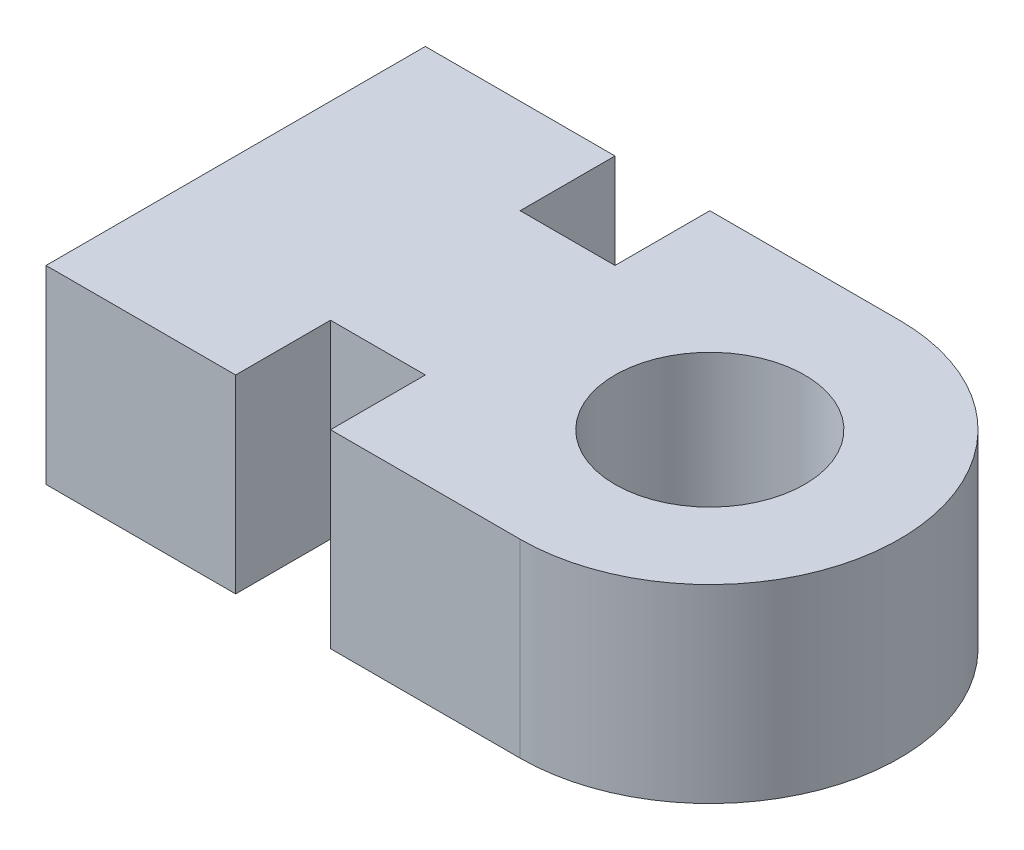
ISO-10303-21;
HEADER;
FILE_DESCRIPTION(('STEP AP214'),'2;1');
FILE_NAME('part.step','',(''),(''),'','','');
FILE_SCHEMA(('AUTOMOTIVE_DESIGN { 1 0 10303 214 1 1 1 1 }'));
ENDSEC;
DATA;
#1=APPLICATION_CONTEXT('core data for automotive mechanical design processes');
#2=APPLICATION_PROTOCOL_DEFINITION('international standard','automotive_design',2000,#1);
#3=PRODUCT_CONTEXT('',#1,'mechanical');
#4=PRODUCT('Part','Part','',(#3));
#5=PRODUCT_RELATED_PRODUCT_CATEGORY('part','',(#4));
#6=PRODUCT_DEFINITION_FORMATION('','',#4);
#7=PRODUCT_DEFINITION_CONTEXT('part definition',#1,'design');
#8=PRODUCT_DEFINITION('design','',#6,#7);
#9=PRODUCT_DEFINITION_SHAPE('','',#8);
#10=(LENGTH_UNIT() NAMED_UNIT(*) SI_UNIT(.MILLI.,.METRE.));
#11=(NAMED_UNIT(*) PLANE_ANGLE_UNIT() SI_UNIT($,.RADIAN.));
#12=(NAMED_UNIT(*) SI_UNIT($,.STERADIAN.) SOLID_ANGLE_UNIT());
#13=UNCERTAINTY_MEASURE_WITH_UNIT(LENGTH_MEASURE(1.E-05),#10,'distance_accuracy_value','');
#14=(GEOMETRIC_REPRESENTATION_CONTEXT(3) GLOBAL_UNCERTAINTY_ASSIGNED_CONTEXT((#13)) GLOBAL_UNIT_ASSIGNED_CONTEXT((#10,
#11,#12)) REPRESENTATION_CONTEXT('',''));
#15=CARTESIAN_POINT('',(0.,0.,0.));
#16=DIRECTION('',(0.,0.,1.));
#17=DIRECTION('',(1.,0.,0.));
#18=AXIS2_PLACEMENT_3D('',#15,#16,#17);
#19=CARTESIAN_POINT('',(0.,10.,10.));
#20=DIRECTION('',(0.,0.,1.));
#21=DIRECTION('',(1.,0.,0.));
#22=AXIS2_PLACEMENT_3D('',#19,#20,#21);
#23=PLANE('',#22);
#24=DIRECTION('',(-1.,0.,0.));
#25=VECTOR('',#24,1.);
#26=CARTESIAN_POINT('',(0.,0.,10.));
#27=LINE('',#26,#25);
#28=CARTESIAN_POINT('',(0.,0.,10.));
#29=VERTEX_POINT('',#28);
#30=CARTESIAN_POINT('',(-10.,0.,10.));
#31=VERTEX_POINT('',#30);
#32=EDGE_CURVE('E187',#29,#31,#27,.T.);
#33=ORIENTED_EDGE('',*,*,#32,.F.);
#34=DIRECTION('',(0.,-1.,0.));
#35=VECTOR('',#34,1.);
#36=CARTESIAN_POINT('',(0.,10.,10.));
#37=LINE('',#36,#35);
#38=CARTESIAN_POINT('',(0.,10.,10.));
#39=VERTEX_POINT('',#38);
#40=EDGE_CURVE('E11',#39,#29,#37,.T.);
#41=ORIENTED_EDGE('',*,*,#40,.F.);
#42=DIRECTION('',(-1.,0.,0.));
#43=VECTOR('',#42,1.);
#44=CARTESIAN_POINT('',(0.,10.,10.));
#45=LINE('',#44,#43);
#46=CARTESIAN_POINT('',(-10.,10.,10.));
#47=VERTEX_POINT('',#46);
#48=EDGE_CURVE('E277',#39,#47,#45,.T.);
#49=ORIENTED_EDGE('',*,*,#48,.T.);
#50=DIRECTION('',(0.,-1.,0.));
#51=VECTOR('',#50,1.);
#52=CARTESIAN_POINT('',(-10.,10.,10.));
#53=LINE('',#52,#51);
#54=EDGE_CURVE('E56',#47,#31,#53,.T.);
#55=ORIENTED_EDGE('',*,*,#54,.T.);
#56=EDGE_LOOP('',(#33,#41,#49,#55));
#57=FACE_BOUND('',#56,.T.);
#58=ADVANCED_FACE('F39',(#57),#23,.T.);
#59=CARTESIAN_POINT('',(0.,10.,0.));
#60=DIRECTION('',(0.,-1.,0.));
#61=DIRECTION('',(0.,0.,-1.));
#62=AXIS2_PLACEMENT_3D('',#59,#60,#61);
#63=CYLINDRICAL_SURFACE('',#62,10.);
#64=CARTESIAN_POINT('',(0.,0.,0.));
#65=DIRECTION('',(0.,1.,0.));
#66=DIRECTION('',(0.,0.,1.));
#67=AXIS2_PLACEMENT_3D('',#64,#65,#66);
#68=CIRCLE('',#67,10.);
#69=CARTESIAN_POINT('',(0.,0.,-10.));
#70=VERTEX_POINT('',#69);
#71=EDGE_CURVE('E184',#29,#70,#68,.T.);
#72=ORIENTED_EDGE('',*,*,#71,.T.);
#73=DIRECTION('',(0.,-1.,0.));
#74=VECTOR('',#73,1.);
#75=CARTESIAN_POINT('',(0.,10.,-10.));
#76=LINE('',#75,#74);
#77=CARTESIAN_POINT('',(0.,10.,-10.));
#78=VERTEX_POINT('',#77);
#79=EDGE_CURVE('E48',#78,#70,#76,.T.);
#80=ORIENTED_EDGE('',*,*,#79,.F.);
#81=CARTESIAN_POINT('',(0.,10.,0.));
#82=DIRECTION('',(0.,1.,0.));
#83=DIRECTION('',(0.,0.,1.));
#84=AXIS2_PLACEMENT_3D('',#81,#82,#83);
#85=CIRCLE('',#84,10.);
#86=EDGE_CURVE('E275',#39,#78,#85,.T.);
#87=ORIENTED_EDGE('',*,*,#86,.F.);
#88=ORIENTED_EDGE('',*,*,#40,.T.);
#89=EDGE_LOOP('',(#72,#80,#87,#88));
#90=FACE_BOUND('',#89,.T.);
#91=ADVANCED_FACE('F185',(#90),#63,.T.);
#92=CARTESIAN_POINT('',(0.,10.,-10.));
#93=DIRECTION('',(0.,0.,1.));
#94=DIRECTION('',(1.,0.,0.));
#95=AXIS2_PLACEMENT_3D('',#92,#93,#94);
#96=PLANE('',#95);
#97=DIRECTION('',(-1.,0.,0.));
#98=VECTOR('',#97,1.);
#99=CARTESIAN_POINT('',(0.,0.,-10.));
#100=LINE('',#99,#98);
#101=CARTESIAN_POINT('',(-10.,0.,-10.));
#102=VERTEX_POINT('',#101);
#103=EDGE_CURVE('E178',#70,#102,#100,.T.);
#104=ORIENTED_EDGE('',*,*,#103,.T.);
#105=DIRECTION('',(0.,-1.,0.));
#106=VECTOR('',#105,1.);
#107=CARTESIAN_POINT('',(-10.,10.,-10.));
#108=LINE('',#107,#106);
#109=CARTESIAN_POINT('',(-10.,10.,-10.));
#110=VERTEX_POINT('',#109);
#111=EDGE_CURVE('E169',#110,#102,#108,.T.);
#112=ORIENTED_EDGE('',*,*,#111,.F.);
#113=DIRECTION('',(-1.,0.,0.));
#114=VECTOR('',#113,1.);
#115=CARTESIAN_POINT('',(0.,10.,-10.));
#116=LINE('',#115,#114);
#117=EDGE_CURVE('E180',#78,#110,#116,.T.);
#118=ORIENTED_EDGE('',*,*,#117,.F.);
#119=ORIENTED_EDGE('',*,*,#79,.T.);
#120=EDGE_LOOP('',(#104,#112,#118,#119));
#121=FACE_BOUND('',#120,.T.);
#122=ADVANCED_FACE('F176',(#121),#96,.F.);
#123=CARTESIAN_POINT('',(-10.,10.,0.));
#124=DIRECTION('',(1.,0.,0.));
#125=DIRECTION('',(0.,0.,-1.));
#126=AXIS2_PLACEMENT_3D('',#123,#124,#125);
#127=PLANE('',#126);
#128=DIRECTION('',(0.,0.,1.));
#129=VECTOR('',#128,1.);
#130=CARTESIAN_POINT('',(-10.,0.,0.));
#131=LINE('',#130,#129);
#132=CARTESIAN_POINT('',(-10.,0.,-5.));
#133=VERTEX_POINT('',#132);
#134=EDGE_CURVE('E189',#102,#133,#131,.T.);
#135=ORIENTED_EDGE('',*,*,#134,.T.);
#136=DIRECTION('',(0.,-1.,0.));
#137=VECTOR('',#136,1.);
#138=CARTESIAN_POINT('',(-10.,10.,-5.));
#139=LINE('',#138,#137);
#140=CARTESIAN_POINT('',(-10.,10.,-5.));
#141=VERTEX_POINT('',#140);
#142=EDGE_CURVE('E167',#141,#133,#139,.T.);
#143=ORIENTED_EDGE('',*,*,#142,.F.);
#144=DIRECTION('',(0.,0.,1.));
#145=VECTOR('',#144,1.);
#146=CARTESIAN_POINT('',(-10.,10.,0.));
#147=LINE('',#146,#145);
#148=EDGE_CURVE('E273',#110,#141,#147,.T.);
#149=ORIENTED_EDGE('',*,*,#148,.F.);
#150=ORIENTED_EDGE('',*,*,#111,.T.);
#151=EDGE_LOOP('',(#135,#143,#149,#150));
#152=FACE_BOUND('',#151,.T.);
#153=ADVANCED_FACE('F272',(#152),#127,.F.);
#154=CARTESIAN_POINT('',(0.,10.,-5.));
#155=DIRECTION('',(0.,0.,-1.));
#156=DIRECTION('',(-1.,0.,0.));
#157=AXIS2_PLACEMENT_3D('',#154,#155,#156);
#158=PLANE('',#157);
#159=DIRECTION('',(1.,0.,0.));
#160=VECTOR('',#159,1.);
#161=CARTESIAN_POINT('',(0.,0.,-5.));
#162=LINE('',#161,#160);
#163=CARTESIAN_POINT('',(-15.,0.,-5.));
#164=VERTEX_POINT('',#163);
#165=EDGE_CURVE('E199',#164,#133,#162,.T.);
#166=ORIENTED_EDGE('',*,*,#165,.F.);
#167=DIRECTION('',(0.,-1.,0.));
#168=VECTOR('',#167,1.);
#169=CARTESIAN_POINT('',(-15.,10.,-5.));
#170=LINE('',#169,#168);
#171=CARTESIAN_POINT('',(-15.,10.,-5.));
#172=VERTEX_POINT('',#171);
#173=EDGE_CURVE('E165',#172,#164,#170,.T.);
#174=ORIENTED_EDGE('',*,*,#173,.F.);
#175=DIRECTION('',(1.,0.,0.));
#176=VECTOR('',#175,1.);
#177=CARTESIAN_POINT('',(0.,10.,-5.));
#178=LINE('',#177,#176);
#179=EDGE_CURVE('E270',#172,#141,#178,.T.);
#180=ORIENTED_EDGE('',*,*,#179,.T.);
#181=ORIENTED_EDGE('',*,*,#142,.T.);
#182=EDGE_LOOP('',(#166,#174,#180,#181));
#183=FACE_BOUND('',#182,.T.);
#184=ADVANCED_FACE('F266',(#183),#158,.T.);
#185=CARTESIAN_POINT('',(-15.,10.,0.));
#186=DIRECTION('',(1.,0.,0.));
#187=DIRECTION('',(0.,0.,-1.));
#188=AXIS2_PLACEMENT_3D('',#185,#186,#187);
#189=PLANE('',#188);
#190=DIRECTION('',(0.,0.,1.));
#191=VECTOR('',#190,1.);
#192=CARTESIAN_POINT('',(-15.,0.,0.));
#193=LINE('',#192,#191);
#194=CARTESIAN_POINT('',(-15.,0.,-10.));
#195=VERTEX_POINT('',#194);
#196=EDGE_CURVE('E202',#195,#164,#193,.T.);
#197=ORIENTED_EDGE('',*,*,#196,.F.);
#198=DIRECTION('',(0.,-1.,0.));
#199=VECTOR('',#198,1.);
#200=CARTESIAN_POINT('',(-15.,10.,-10.));
#201=LINE('',#200,#199);
#202=CARTESIAN_POINT('',(-15.,10.,-10.));
#203=VERTEX_POINT('',#202);
#204=EDGE_CURVE('E163',#203,#195,#201,.T.);
#205=ORIENTED_EDGE('',*,*,#204,.F.);
#206=DIRECTION('',(0.,0.,1.));
#207=VECTOR('',#206,1.);
#208=CARTESIAN_POINT('',(-15.,10.,0.));
#209=LINE('',#208,#207);
#210=EDGE_CURVE('E263',#203,#172,#209,.T.);
#211=ORIENTED_EDGE('',*,*,#210,.T.);
#212=ORIENTED_EDGE('',*,*,#173,.T.);
#213=EDGE_LOOP('',(#197,#205,#211,#212));
#214=FACE_BOUND('',#213,.T.);
#215=ADVANCED_FACE('F262',(#214),#189,.T.);
#216=CARTESIAN_POINT('',(-25.,0.,-10.));
#217=VERTEX_POINT('',#216);
#218=EDGE_CURVE('E191',#195,#217,#100,.T.);
#219=ORIENTED_EDGE('',*,*,#218,.T.);
#220=DIRECTION('',(0.,-1.,0.));
#221=VECTOR('',#220,1.);
#222=CARTESIAN_POINT('',(-25.,10.,-10.));
#223=LINE('',#222,#221);
#224=CARTESIAN_POINT('',(-25.,10.,-10.));
#225=VERTEX_POINT('',#224);
#226=EDGE_CURVE('E160',#225,#217,#223,.T.);
#227=ORIENTED_EDGE('',*,*,#226,.F.);
#228=EDGE_CURVE('E258',#203,#225,#116,.T.);
#229=ORIENTED_EDGE('',*,*,#228,.F.);
#230=ORIENTED_EDGE('',*,*,#204,.T.);
#231=EDGE_LOOP('',(#219,#227,#229,#230));
#232=FACE_BOUND('',#231,.T.);
#233=ADVANCED_FACE('F245',(#232),#96,.F.);
#234=CARTESIAN_POINT('',(-25.,10.,0.));
#235=DIRECTION('',(1.,0.,0.));
#236=DIRECTION('',(0.,0.,-1.));
#237=AXIS2_PLACEMENT_3D('',#234,#235,#236);
#238=PLANE('',#237);
#239=DIRECTION('',(0.,0.,1.));
#240=VECTOR('',#239,1.);
#241=CARTESIAN_POINT('',(-25.,0.,0.));
#242=LINE('',#241,#240);
#243=CARTESIAN_POINT('',(-25.,0.,10.));
#244=VERTEX_POINT('',#243);
#245=EDGE_CURVE('E205',#217,#244,#242,.T.);
#246=ORIENTED_EDGE('',*,*,#245,.T.);
#247=DIRECTION('',(0.,-1.,0.));
#248=VECTOR('',#247,1.);
#249=CARTESIAN_POINT('',(-25.,10.,10.));
#250=LINE('',#249,#248);
#251=CARTESIAN_POINT('',(-25.,10.,10.));
#252=VERTEX_POINT('',#251);
#253=EDGE_CURVE('E154',#252,#244,#250,.T.);
#254=ORIENTED_EDGE('',*,*,#253,.F.);
#255=DIRECTION('',(0.,0.,1.));
#256=VECTOR('',#255,1.);
#257=CARTESIAN_POINT('',(-25.,10.,0.));
#258=LINE('',#257,#256);
#259=EDGE_CURVE('E254',#225,#252,#258,.T.);
#260=ORIENTED_EDGE('',*,*,#259,.F.);
#261=ORIENTED_EDGE('',*,*,#226,.T.);
#262=EDGE_LOOP('',(#246,#254,#260,#261));
#263=FACE_BOUND('',#262,.T.);
#264=ADVANCED_FACE('F239',(#263),#238,.F.);
#265=CARTESIAN_POINT('',(-15.,0.,10.));
#266=VERTEX_POINT('',#265);
#267=EDGE_CURVE('E194',#266,#244,#27,.T.);
#268=ORIENTED_EDGE('',*,*,#267,.F.);
#269=DIRECTION('',(0.,-1.,0.));
#270=VECTOR('',#269,1.);
#271=CARTESIAN_POINT('',(-15.,10.,10.));
#272=LINE('',#271,#270);
#273=CARTESIAN_POINT('',(-15.,10.,10.));
#274=VERTEX_POINT('',#273);
#275=EDGE_CURVE('E152',#274,#266,#272,.T.);
#276=ORIENTED_EDGE('',*,*,#275,.F.);
#277=EDGE_CURVE('E146',#274,#252,#45,.T.);
#278=ORIENTED_EDGE('',*,*,#277,.T.);
#279=ORIENTED_EDGE('',*,*,#253,.T.);
#280=EDGE_LOOP('',(#268,#276,#278,#279));
#281=FACE_BOUND('',#280,.T.);
#282=ADVANCED_FACE('F232',(#281),#23,.T.);
#283=CARTESIAN_POINT('',(-15.,10.,0.));
#284=DIRECTION('',(-1.,0.,0.));
#285=DIRECTION('',(0.,0.,1.));
#286=AXIS2_PLACEMENT_3D('',#283,#284,#285);
#287=PLANE('',#286);
#288=DIRECTION('',(0.,0.,-1.));
#289=VECTOR('',#288,1.);
#290=CARTESIAN_POINT('',(-15.,0.,0.));
#291=LINE('',#290,#289);
#292=CARTESIAN_POINT('',(-15.,0.,5.));
#293=VERTEX_POINT('',#292);
#294=EDGE_CURVE('E151',#266,#293,#291,.T.);
#295=ORIENTED_EDGE('',*,*,#294,.T.);
#296=DIRECTION('',(0.,-1.,0.));
#297=VECTOR('',#296,1.);
#298=CARTESIAN_POINT('',(-15.,10.,5.));
#299=LINE('',#298,#297);
#300=CARTESIAN_POINT('',(-15.,10.,5.));
#301=VERTEX_POINT('',#300);
#302=EDGE_CURVE('E134',#301,#293,#299,.T.);
#303=ORIENTED_EDGE('',*,*,#302,.F.);
#304=DIRECTION('',(0.,0.,-1.));
#305=VECTOR('',#304,1.);
#306=CARTESIAN_POINT('',(-15.,10.,0.));
#307=LINE('',#306,#305);
#308=EDGE_CURVE('E139',#274,#301,#307,.T.);
#309=ORIENTED_EDGE('',*,*,#308,.F.);
#310=ORIENTED_EDGE('',*,*,#275,.T.);
#311=EDGE_LOOP('',(#295,#303,#309,#310));
#312=FACE_BOUND('',#311,.T.);
#313=ADVANCED_FACE('F149',(#312),#287,.F.);
#314=CARTESIAN_POINT('',(0.,10.,5.));
#315=DIRECTION('',(0.,0.,-1.));
#316=DIRECTION('',(-1.,0.,0.));
#317=AXIS2_PLACEMENT_3D('',#314,#315,#316);
#318=PLANE('',#317);
#319=DIRECTION('',(1.,0.,0.));
#320=VECTOR('',#319,1.);
#321=CARTESIAN_POINT('',(0.,0.,5.));
#322=LINE('',#321,#320);
#323=CARTESIAN_POINT('',(-10.,0.,5.));
#324=VERTEX_POINT('',#323);
#325=EDGE_CURVE('E209',#293,#324,#322,.T.);
#326=ORIENTED_EDGE('',*,*,#325,.T.);
#327=DIRECTION('',(0.,-1.,0.));
#328=VECTOR('',#327,1.);
#329=CARTESIAN_POINT('',(-10.,10.,5.));
#330=LINE('',#329,#328);
#331=CARTESIAN_POINT('',(-10.,10.,5.));
#332=VERTEX_POINT('',#331);
#333=EDGE_CURVE('E94',#332,#324,#330,.T.);
#334=ORIENTED_EDGE('',*,*,#333,.F.);
#335=DIRECTION('',(1.,0.,0.));
#336=VECTOR('',#335,1.);
#337=CARTESIAN_POINT('',(0.,10.,5.));
#338=LINE('',#337,#336);
#339=EDGE_CURVE('E130',#301,#332,#338,.T.);
#340=ORIENTED_EDGE('',*,*,#339,.F.);
#341=ORIENTED_EDGE('',*,*,#302,.T.);
#342=EDGE_LOOP('',(#326,#334,#340,#341));
#343=FACE_BOUND('',#342,.T.);
#344=ADVANCED_FACE('F132',(#343),#318,.F.);
#345=CARTESIAN_POINT('',(0.,10.,0.));
#346=DIRECTION('',(0.,-1.,0.));
#347=DIRECTION('',(0.,0.,-1.));
#348=AXIS2_PLACEMENT_3D('',#345,#346,#347);
#349=CYLINDRICAL_SURFACE('',#348,5.);
#350=CARTESIAN_POINT('',(0.,10.,0.));
#351=DIRECTION('',(0.,1.,0.));
#352=DIRECTION('',(0.,0.,1.));
#353=AXIS2_PLACEMENT_3D('',#350,#351,#352);
#354=CIRCLE('',#353,5.);
#355=CARTESIAN_POINT('',(0.,10.,5.));
#356=VERTEX_POINT('',#355);
#357=EDGE_CURVE('E213',#356,#356,#354,.T.);
#358=ORIENTED_EDGE('',*,*,#357,.T.);
#359=EDGE_LOOP('',(#358));
#360=FACE_BOUND('',#359,.T.);
#361=CARTESIAN_POINT('',(0.,0.,0.));
#362=DIRECTION('',(0.,1.,0.));
#363=DIRECTION('',(0.,0.,1.));
#364=AXIS2_PLACEMENT_3D('',#361,#362,#363);
#365=CIRCLE('',#364,5.);
#366=CARTESIAN_POINT('',(0.,0.,5.));
#367=VERTEX_POINT('',#366);
#368=EDGE_CURVE('E192',#367,#367,#365,.T.);
#369=ORIENTED_EDGE('',*,*,#368,.F.);
#370=EDGE_LOOP('',(#369));
#371=FACE_BOUND('',#370,.T.);
#372=ADVANCED_FACE('F41',(#360,#371),#349,.F.);
#373=CARTESIAN_POINT('',(-10.,10.,0.));
#374=DIRECTION('',(-1.,0.,0.));
#375=DIRECTION('',(0.,0.,1.));
#376=AXIS2_PLACEMENT_3D('',#373,#374,#375);
#377=PLANE('',#376);
#378=DIRECTION('',(0.,0.,-1.));
#379=VECTOR('',#378,1.);
#380=CARTESIAN_POINT('',(-10.,0.,0.));
#381=LINE('',#380,#379);
#382=EDGE_CURVE('E211',#31,#324,#381,.T.);
#383=ORIENTED_EDGE('',*,*,#382,.F.);
#384=ORIENTED_EDGE('',*,*,#54,.F.);
#385=DIRECTION('',(0.,0.,-1.));
#386=VECTOR('',#385,1.);
#387=CARTESIAN_POINT('',(-10.,10.,0.));
#388=LINE('',#387,#386);
#389=EDGE_CURVE('E138',#47,#332,#388,.T.);
#390=ORIENTED_EDGE('',*,*,#389,.T.);
#391=ORIENTED_EDGE('',*,*,#333,.T.);
#392=EDGE_LOOP('',(#383,#384,#390,#391));
#393=FACE_BOUND('',#392,.T.);
#394=ADVANCED_FACE('F221',(#393),#377,.T.);
#395=CARTESIAN_POINT('',(0.,10.,0.));
#396=DIRECTION('',(0.,1.,0.));
#397=DIRECTION('',(0.,0.,1.));
#398=AXIS2_PLACEMENT_3D('',#395,#396,#397);
#399=PLANE('',#398);
#400=ORIENTED_EDGE('',*,*,#357,.F.);
#401=EDGE_LOOP('',(#400));
#402=FACE_BOUND('',#401,.T.);
#403=ORIENTED_EDGE('',*,*,#48,.F.);
#404=ORIENTED_EDGE('',*,*,#86,.T.);
#405=ORIENTED_EDGE('',*,*,#117,.T.);
#406=ORIENTED_EDGE('',*,*,#148,.T.);
#407=ORIENTED_EDGE('',*,*,#179,.F.);
#408=ORIENTED_EDGE('',*,*,#210,.F.);
#409=ORIENTED_EDGE('',*,*,#228,.T.);
#410=ORIENTED_EDGE('',*,*,#259,.T.);
#411=ORIENTED_EDGE('',*,*,#277,.F.);
#412=ORIENTED_EDGE('',*,*,#308,.T.);
#413=ORIENTED_EDGE('',*,*,#339,.T.);
#414=ORIENTED_EDGE('',*,*,#389,.F.);
#415=EDGE_LOOP('',(#403,#404,#405,#406,#407,#408,#409,#410,#411,#412,#413,#414));
#416=FACE_BOUND('',#415,.T.);
#417=ADVANCED_FACE('F144',(#402,#416),#399,.T.);
#418=CARTESIAN_POINT('',(0.,0.,0.));
#419=DIRECTION('',(0.,1.,0.));
#420=DIRECTION('',(0.,0.,1.));
#421=AXIS2_PLACEMENT_3D('',#418,#419,#420);
#422=PLANE('',#421);
#423=ORIENTED_EDGE('',*,*,#368,.T.);
#424=EDGE_LOOP('',(#423));
#425=FACE_BOUND('',#424,.T.);
#426=ORIENTED_EDGE('',*,*,#32,.T.);
#427=ORIENTED_EDGE('',*,*,#382,.T.);
#428=ORIENTED_EDGE('',*,*,#325,.F.);
#429=ORIENTED_EDGE('',*,*,#294,.F.);
#430=ORIENTED_EDGE('',*,*,#267,.T.);
#431=ORIENTED_EDGE('',*,*,#245,.F.);
#432=ORIENTED_EDGE('',*,*,#218,.F.);
#433=ORIENTED_EDGE('',*,*,#196,.T.);
#434=ORIENTED_EDGE('',*,*,#165,.T.);
#435=ORIENTED_EDGE('',*,*,#134,.F.);
#436=ORIENTED_EDGE('',*,*,#103,.F.);
#437=ORIENTED_EDGE('',*,*,#71,.F.);
#438=EDGE_LOOP('',(#426,#427,#428,#429,#430,#431,#432,#433,#434,#435,#436,#437));
#439=FACE_BOUND('',#438,.T.);
#440=ADVANCED_FACE('F218',(#425,#439),#422,.F.);
#441=CLOSED_SHELL('',(#58,#91,#122,#153,#184,#215,#233,#264,#282,#313,#344,#372,#394,#417,#440));
#442=MANIFOLD_SOLID_BREP('B2',#441);
#443=ADVANCED_BREP_SHAPE_REPRESENTATION('',(#18,#442),#14);
#444=SHAPE_DEFINITION_REPRESENTATION(#9,#443);
ENDSEC;
END-ISO-10303-21;
